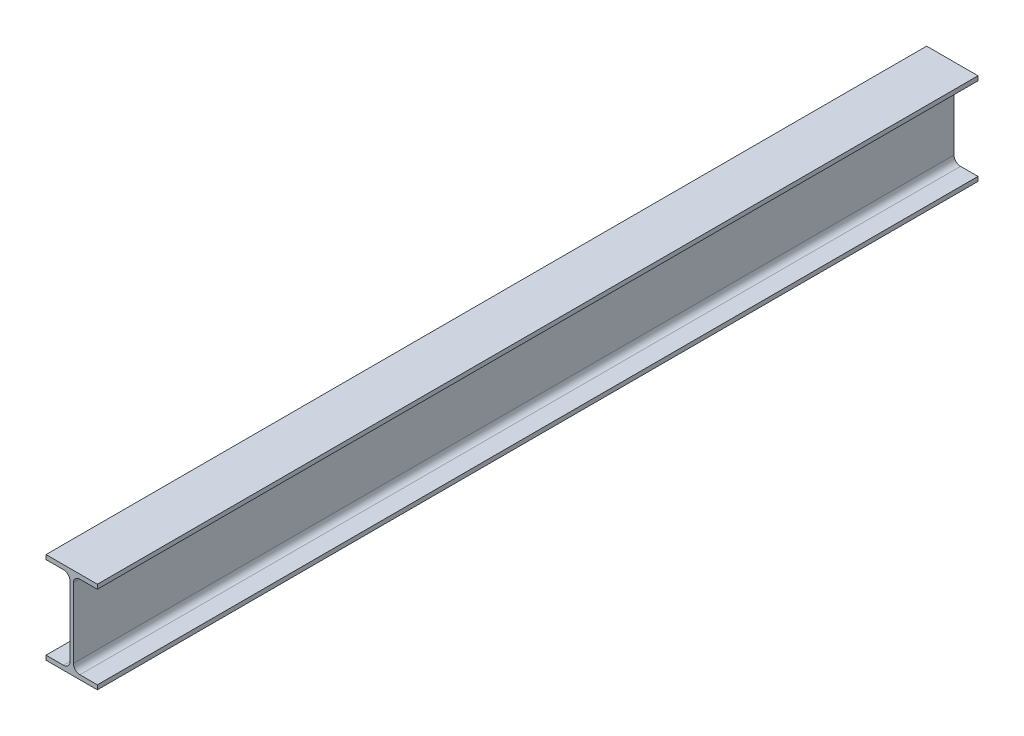
ISO-10303-21;
HEADER;
FILE_DESCRIPTION(('STEP AP214'),'2;1');
FILE_NAME('part.step','',(''),(''),'','','');
FILE_SCHEMA(('AUTOMOTIVE_DESIGN { 1 0 10303 214 1 1 1 1 }'));
ENDSEC;
DATA;
#1=APPLICATION_CONTEXT('core data for automotive mechanical design processes');
#2=APPLICATION_PROTOCOL_DEFINITION('international standard','automotive_design',2000,#1);
#3=PRODUCT_CONTEXT('',#1,'mechanical');
#4=PRODUCT('Part','Part','',(#3));
#5=PRODUCT_RELATED_PRODUCT_CATEGORY('part','',(#4));
#6=PRODUCT_DEFINITION_FORMATION('','',#4);
#7=PRODUCT_DEFINITION_CONTEXT('part definition',#1,'design');
#8=PRODUCT_DEFINITION('design','',#6,#7);
#9=PRODUCT_DEFINITION_SHAPE('','',#8);
#10=(LENGTH_UNIT() NAMED_UNIT(*) SI_UNIT(.MILLI.,.METRE.));
#11=(NAMED_UNIT(*) PLANE_ANGLE_UNIT() SI_UNIT($,.RADIAN.));
#12=(NAMED_UNIT(*) SI_UNIT($,.STERADIAN.) SOLID_ANGLE_UNIT());
#13=UNCERTAINTY_MEASURE_WITH_UNIT(LENGTH_MEASURE(1.E-05),#10,'distance_accuracy_value','');
#14=(GEOMETRIC_REPRESENTATION_CONTEXT(3) GLOBAL_UNCERTAINTY_ASSIGNED_CONTEXT((#13)) GLOBAL_UNIT_ASSIGNED_CONTEXT((#10,
#11,#12)) REPRESENTATION_CONTEXT('',''));
#15=CARTESIAN_POINT('',(0.,0.,0.));
#16=DIRECTION('',(0.,0.,1.));
#17=DIRECTION('',(1.,0.,0.));
#18=AXIS2_PLACEMENT_3D('',#15,#16,#17);
#19=CARTESIAN_POINT('',(-27.5,44.3,943.));
#20=DIRECTION('',(1.,0.,0.));
#21=DIRECTION('',(0.,0.,-1.));
#22=AXIS2_PLACEMENT_3D('',#19,#20,#21);
#23=PLANE('',#22);
#24=DIRECTION('',(0.,-1.,0.));
#25=VECTOR('',#24,1.);
#26=CARTESIAN_POINT('',(-27.5,44.3,0.));
#27=LINE('',#26,#25);
#28=CARTESIAN_POINT('',(-27.5,49.,0.));
#29=VERTEX_POINT('',#28);
#30=CARTESIAN_POINT('',(-27.5,44.3,0.));
#31=VERTEX_POINT('',#30);
#32=EDGE_CURVE('E183',#29,#31,#27,.T.);
#33=ORIENTED_EDGE('',*,*,#32,.T.);
#34=DIRECTION('',(0.,0.,-1.));
#35=VECTOR('',#34,1.);
#36=CARTESIAN_POINT('',(-27.5,44.3,943.));
#37=LINE('',#36,#35);
#38=CARTESIAN_POINT('',(-27.5,44.3,943.));
#39=VERTEX_POINT('',#38);
#40=EDGE_CURVE('E11',#39,#31,#37,.T.);
#41=ORIENTED_EDGE('',*,*,#40,.F.);
#42=DIRECTION('',(0.,-1.,0.));
#43=VECTOR('',#42,1.);
#44=CARTESIAN_POINT('',(-27.5,44.3,943.));
#45=LINE('',#44,#43);
#46=CARTESIAN_POINT('',(-27.5,49.,943.));
#47=VERTEX_POINT('',#46);
#48=EDGE_CURVE('E213',#47,#39,#45,.T.);
#49=ORIENTED_EDGE('',*,*,#48,.F.);
#50=DIRECTION('',(0.,0.,-1.));
#51=VECTOR('',#50,1.);
#52=CARTESIAN_POINT('',(-27.5,49.,943.));
#53=LINE('',#52,#51);
#54=EDGE_CURVE('E179',#47,#29,#53,.T.);
#55=ORIENTED_EDGE('',*,*,#54,.T.);
#56=EDGE_LOOP('',(#33,#41,#49,#55));
#57=FACE_BOUND('',#56,.T.);
#58=ADVANCED_FACE('F39',(#57),#23,.F.);
#59=CARTESIAN_POINT('',(-8.8,44.3,943.));
#60=DIRECTION('',(0.,1.,0.));
#61=DIRECTION('',(0.,0.,1.));
#62=AXIS2_PLACEMENT_3D('',#59,#60,#61);
#63=PLANE('',#62);
#64=DIRECTION('',(1.,0.,0.));
#65=VECTOR('',#64,1.);
#66=CARTESIAN_POINT('',(-8.8,44.3,0.));
#67=LINE('',#66,#65);
#68=CARTESIAN_POINT('',(-8.8,44.3,0.));
#69=VERTEX_POINT('',#68);
#70=EDGE_CURVE('E186',#31,#69,#67,.T.);
#71=ORIENTED_EDGE('',*,*,#70,.T.);
#72=DIRECTION('',(0.,0.,-1.));
#73=VECTOR('',#72,1.);
#74=CARTESIAN_POINT('',(-8.8,44.3,943.));
#75=LINE('',#74,#73);
#76=CARTESIAN_POINT('',(-8.8,44.3,943.));
#77=VERTEX_POINT('',#76);
#78=EDGE_CURVE('E47',#77,#69,#75,.T.);
#79=ORIENTED_EDGE('',*,*,#78,.F.);
#80=DIRECTION('',(1.,0.,0.));
#81=VECTOR('',#80,1.);
#82=CARTESIAN_POINT('',(-8.8,44.3,943.));
#83=LINE('',#82,#81);
#84=EDGE_CURVE('E122',#39,#77,#83,.T.);
#85=ORIENTED_EDGE('',*,*,#84,.F.);
#86=ORIENTED_EDGE('',*,*,#40,.T.);
#87=EDGE_LOOP('',(#71,#79,#85,#86));
#88=FACE_BOUND('',#87,.T.);
#89=ADVANCED_FACE('F311',(#88),#63,.F.);
#90=CARTESIAN_POINT('',(-8.8,37.3,943.));
#91=DIRECTION('',(0.,0.,-1.));
#92=DIRECTION('',(-1.,0.,0.));
#93=AXIS2_PLACEMENT_3D('',#90,#91,#92);
#94=CYLINDRICAL_SURFACE('',#93,7.);
#95=CARTESIAN_POINT('',(-8.8,37.3,0.));
#96=DIRECTION('',(0.,0.,-1.));
#97=DIRECTION('',(-1.,0.,0.));
#98=AXIS2_PLACEMENT_3D('',#95,#96,#97);
#99=CIRCLE('',#98,7.);
#100=CARTESIAN_POINT('',(-1.8,37.3,0.));
#101=VERTEX_POINT('',#100);
#102=EDGE_CURVE('E188',#69,#101,#99,.T.);
#103=ORIENTED_EDGE('',*,*,#102,.T.);
#104=DIRECTION('',(0.,0.,-1.));
#105=VECTOR('',#104,1.);
#106=CARTESIAN_POINT('',(-1.8,37.3,943.));
#107=LINE('',#106,#105);
#108=CARTESIAN_POINT('',(-1.8,37.3,943.));
#109=VERTEX_POINT('',#108);
#110=EDGE_CURVE('E244',#109,#101,#107,.T.);
#111=ORIENTED_EDGE('',*,*,#110,.F.);
#112=CARTESIAN_POINT('',(-8.8,37.3,943.));
#113=DIRECTION('',(0.,0.,-1.));
#114=DIRECTION('',(-1.,0.,0.));
#115=AXIS2_PLACEMENT_3D('',#112,#113,#114);
#116=CIRCLE('',#115,7.);
#117=EDGE_CURVE('E252',#77,#109,#116,.T.);
#118=ORIENTED_EDGE('',*,*,#117,.F.);
#119=ORIENTED_EDGE('',*,*,#78,.T.);
#120=EDGE_LOOP('',(#103,#111,#118,#119));
#121=FACE_BOUND('',#120,.T.);
#122=ADVANCED_FACE('F250',(#121),#94,.F.);
#123=CARTESIAN_POINT('',(-1.8,-37.3,943.));
#124=DIRECTION('',(1.,0.,0.));
#125=DIRECTION('',(0.,1.,0.));
#126=AXIS2_PLACEMENT_3D('',#123,#124,#125);
#127=PLANE('',#126);
#128=DIRECTION('',(0.,-1.,0.));
#129=VECTOR('',#128,1.);
#130=CARTESIAN_POINT('',(-1.8,-37.3,0.));
#131=LINE('',#130,#129);
#132=CARTESIAN_POINT('',(-1.8,-37.3,0.));
#133=VERTEX_POINT('',#132);
#134=EDGE_CURVE('E190',#101,#133,#131,.T.);
#135=ORIENTED_EDGE('',*,*,#134,.T.);
#136=DIRECTION('',(0.,0.,-1.));
#137=VECTOR('',#136,1.);
#138=CARTESIAN_POINT('',(-1.8,-37.3,943.));
#139=LINE('',#138,#137);
#140=CARTESIAN_POINT('',(-1.8,-37.3,943.));
#141=VERTEX_POINT('',#140);
#142=EDGE_CURVE('E241',#141,#133,#139,.T.);
#143=ORIENTED_EDGE('',*,*,#142,.F.);
#144=DIRECTION('',(0.,-1.,0.));
#145=VECTOR('',#144,1.);
#146=CARTESIAN_POINT('',(-1.8,-37.3,943.));
#147=LINE('',#146,#145);
#148=EDGE_CURVE('E270',#109,#141,#147,.T.);
#149=ORIENTED_EDGE('',*,*,#148,.F.);
#150=ORIENTED_EDGE('',*,*,#110,.T.);
#151=EDGE_LOOP('',(#135,#143,#149,#150));
#152=FACE_BOUND('',#151,.T.);
#153=ADVANCED_FACE('F261',(#152),#127,.F.);
#154=CARTESIAN_POINT('',(-8.8,-37.3,943.));
#155=DIRECTION('',(0.,0.,-1.));
#156=DIRECTION('',(-1.,0.,0.));
#157=AXIS2_PLACEMENT_3D('',#154,#155,#156);
#158=CYLINDRICAL_SURFACE('',#157,7.);
#159=CARTESIAN_POINT('',(-8.8,-37.3,0.));
#160=DIRECTION('',(0.,0.,-1.));
#161=DIRECTION('',(-1.,0.,0.));
#162=AXIS2_PLACEMENT_3D('',#159,#160,#161);
#163=CIRCLE('',#162,7.);
#164=CARTESIAN_POINT('',(-8.8,-44.3,0.));
#165=VERTEX_POINT('',#164);
#166=EDGE_CURVE('E192',#133,#165,#163,.T.);
#167=ORIENTED_EDGE('',*,*,#166,.T.);
#168=DIRECTION('',(0.,0.,-1.));
#169=VECTOR('',#168,1.);
#170=CARTESIAN_POINT('',(-8.8,-44.3,943.));
#171=LINE('',#170,#169);
#172=CARTESIAN_POINT('',(-8.8,-44.3,943.));
#173=VERTEX_POINT('',#172);
#174=EDGE_CURVE('E238',#173,#165,#171,.T.);
#175=ORIENTED_EDGE('',*,*,#174,.F.);
#176=CARTESIAN_POINT('',(-8.8,-37.3,943.));
#177=DIRECTION('',(0.,0.,-1.));
#178=DIRECTION('',(-1.,0.,0.));
#179=AXIS2_PLACEMENT_3D('',#176,#177,#178);
#180=CIRCLE('',#179,7.);
#181=EDGE_CURVE('E267',#141,#173,#180,.T.);
#182=ORIENTED_EDGE('',*,*,#181,.F.);
#183=ORIENTED_EDGE('',*,*,#142,.T.);
#184=EDGE_LOOP('',(#167,#175,#182,#183));
#185=FACE_BOUND('',#184,.T.);
#186=ADVANCED_FACE('F265',(#185),#158,.F.);
#187=CARTESIAN_POINT('',(-27.5,-44.3,943.));
#188=DIRECTION('',(0.,-1.,0.));
#189=DIRECTION('',(0.,0.,-1.));
#190=AXIS2_PLACEMENT_3D('',#187,#188,#189);
#191=PLANE('',#190);
#192=DIRECTION('',(-1.,0.,0.));
#193=VECTOR('',#192,1.);
#194=CARTESIAN_POINT('',(-27.5,-44.3,0.));
#195=LINE('',#194,#193);
#196=CARTESIAN_POINT('',(-27.5,-44.3,0.));
#197=VERTEX_POINT('',#196);
#198=EDGE_CURVE('E194',#165,#197,#195,.T.);
#199=ORIENTED_EDGE('',*,*,#198,.T.);
#200=DIRECTION('',(0.,0.,-1.));
#201=VECTOR('',#200,1.);
#202=CARTESIAN_POINT('',(-27.5,-44.3,943.));
#203=LINE('',#202,#201);
#204=CARTESIAN_POINT('',(-27.5,-44.3,943.));
#205=VERTEX_POINT('',#204);
#206=EDGE_CURVE('E235',#205,#197,#203,.T.);
#207=ORIENTED_EDGE('',*,*,#206,.F.);
#208=DIRECTION('',(-1.,0.,0.));
#209=VECTOR('',#208,1.);
#210=CARTESIAN_POINT('',(-27.5,-44.3,943.));
#211=LINE('',#210,#209);
#212=EDGE_CURVE('E269',#173,#205,#211,.T.);
#213=ORIENTED_EDGE('',*,*,#212,.F.);
#214=ORIENTED_EDGE('',*,*,#174,.T.);
#215=EDGE_LOOP('',(#199,#207,#213,#214));
#216=FACE_BOUND('',#215,.T.);
#217=ADVANCED_FACE('F324',(#216),#191,.F.);
#218=CARTESIAN_POINT('',(-27.5,-49.,943.));
#219=DIRECTION('',(1.,0.,0.));
#220=DIRECTION('',(0.,0.,-1.));
#221=AXIS2_PLACEMENT_3D('',#218,#219,#220);
#222=PLANE('',#221);
#223=DIRECTION('',(0.,-1.,0.));
#224=VECTOR('',#223,1.);
#225=CARTESIAN_POINT('',(-27.5,-49.,0.));
#226=LINE('',#225,#224);
#227=CARTESIAN_POINT('',(-27.5,-49.,0.));
#228=VERTEX_POINT('',#227);
#229=EDGE_CURVE('E196',#197,#228,#226,.T.);
#230=ORIENTED_EDGE('',*,*,#229,.T.);
#231=DIRECTION('',(0.,0.,-1.));
#232=VECTOR('',#231,1.);
#233=CARTESIAN_POINT('',(-27.5,-49.,943.));
#234=LINE('',#233,#232);
#235=CARTESIAN_POINT('',(-27.5,-49.,943.));
#236=VERTEX_POINT('',#235);
#237=EDGE_CURVE('E232',#236,#228,#234,.T.);
#238=ORIENTED_EDGE('',*,*,#237,.F.);
#239=DIRECTION('',(0.,-1.,0.));
#240=VECTOR('',#239,1.);
#241=CARTESIAN_POINT('',(-27.5,-49.,943.));
#242=LINE('',#241,#240);
#243=EDGE_CURVE('E272',#205,#236,#242,.T.);
#244=ORIENTED_EDGE('',*,*,#243,.F.);
#245=ORIENTED_EDGE('',*,*,#206,.T.);
#246=EDGE_LOOP('',(#230,#238,#244,#245));
#247=FACE_BOUND('',#246,.T.);
#248=ADVANCED_FACE('F327',(#247),#222,.F.);
#249=CARTESIAN_POINT('',(27.5,-49.,943.));
#250=DIRECTION('',(0.,1.,0.));
#251=DIRECTION('',(-1.,0.,0.));
#252=AXIS2_PLACEMENT_3D('',#249,#250,#251);
#253=PLANE('',#252);
#254=DIRECTION('',(1.,0.,0.));
#255=VECTOR('',#254,1.);
#256=CARTESIAN_POINT('',(27.5,-49.,0.));
#257=LINE('',#256,#255);
#258=CARTESIAN_POINT('',(27.5,-49.,0.));
#259=VERTEX_POINT('',#258);
#260=EDGE_CURVE('E198',#228,#259,#257,.T.);
#261=ORIENTED_EDGE('',*,*,#260,.T.);
#262=DIRECTION('',(0.,0.,-1.));
#263=VECTOR('',#262,1.);
#264=CARTESIAN_POINT('',(27.5,-49.,943.));
#265=LINE('',#264,#263);
#266=CARTESIAN_POINT('',(27.5,-49.,943.));
#267=VERTEX_POINT('',#266);
#268=EDGE_CURVE('E229',#267,#259,#265,.T.);
#269=ORIENTED_EDGE('',*,*,#268,.F.);
#270=DIRECTION('',(1.,0.,0.));
#271=VECTOR('',#270,1.);
#272=CARTESIAN_POINT('',(27.5,-49.,943.));
#273=LINE('',#272,#271);
#274=EDGE_CURVE('E278',#236,#267,#273,.T.);
#275=ORIENTED_EDGE('',*,*,#274,.F.);
#276=ORIENTED_EDGE('',*,*,#237,.T.);
#277=EDGE_LOOP('',(#261,#269,#275,#276));
#278=FACE_BOUND('',#277,.T.);
#279=ADVANCED_FACE('F331',(#278),#253,.F.);
#280=CARTESIAN_POINT('',(27.5,-44.3,943.));
#281=DIRECTION('',(-1.,0.,0.));
#282=DIRECTION('',(0.,0.,1.));
#283=AXIS2_PLACEMENT_3D('',#280,#281,#282);
#284=PLANE('',#283);
#285=DIRECTION('',(0.,1.,0.));
#286=VECTOR('',#285,1.);
#287=CARTESIAN_POINT('',(27.5,-44.3,0.));
#288=LINE('',#287,#286);
#289=CARTESIAN_POINT('',(27.5,-44.3,0.));
#290=VERTEX_POINT('',#289);
#291=EDGE_CURVE('E200',#259,#290,#288,.T.);
#292=ORIENTED_EDGE('',*,*,#291,.T.);
#293=DIRECTION('',(0.,0.,-1.));
#294=VECTOR('',#293,1.);
#295=CARTESIAN_POINT('',(27.5,-44.3,943.));
#296=LINE('',#295,#294);
#297=CARTESIAN_POINT('',(27.5,-44.3,943.));
#298=VERTEX_POINT('',#297);
#299=EDGE_CURVE('E226',#298,#290,#296,.T.);
#300=ORIENTED_EDGE('',*,*,#299,.F.);
#301=DIRECTION('',(0.,1.,0.));
#302=VECTOR('',#301,1.);
#303=CARTESIAN_POINT('',(27.5,-44.3,943.));
#304=LINE('',#303,#302);
#305=EDGE_CURVE('E280',#267,#298,#304,.T.);
#306=ORIENTED_EDGE('',*,*,#305,.F.);
#307=ORIENTED_EDGE('',*,*,#268,.T.);
#308=EDGE_LOOP('',(#292,#300,#306,#307));
#309=FACE_BOUND('',#308,.T.);
#310=ADVANCED_FACE('F335',(#309),#284,.F.);
#311=CARTESIAN_POINT('',(8.80000000000001,-44.3,943.));
#312=DIRECTION('',(0.,-1.,0.));
#313=DIRECTION('',(1.,0.,0.));
#314=AXIS2_PLACEMENT_3D('',#311,#312,#313);
#315=PLANE('',#314);
#316=DIRECTION('',(-1.,0.,0.));
#317=VECTOR('',#316,1.);
#318=CARTESIAN_POINT('',(8.80000000000001,-44.3,0.));
#319=LINE('',#318,#317);
#320=CARTESIAN_POINT('',(8.80000000000001,-44.3,0.));
#321=VERTEX_POINT('',#320);
#322=EDGE_CURVE('E202',#290,#321,#319,.T.);
#323=ORIENTED_EDGE('',*,*,#322,.T.);
#324=DIRECTION('',(0.,0.,-1.));
#325=VECTOR('',#324,1.);
#326=CARTESIAN_POINT('',(8.80000000000001,-44.3,943.));
#327=LINE('',#326,#325);
#328=CARTESIAN_POINT('',(8.80000000000001,-44.3,943.));
#329=VERTEX_POINT('',#328);
#330=EDGE_CURVE('E223',#329,#321,#327,.T.);
#331=ORIENTED_EDGE('',*,*,#330,.F.);
#332=DIRECTION('',(-1.,0.,0.));
#333=VECTOR('',#332,1.);
#334=CARTESIAN_POINT('',(8.80000000000001,-44.3,943.));
#335=LINE('',#334,#333);
#336=EDGE_CURVE('E282',#298,#329,#335,.T.);
#337=ORIENTED_EDGE('',*,*,#336,.F.);
#338=ORIENTED_EDGE('',*,*,#299,.T.);
#339=EDGE_LOOP('',(#323,#331,#337,#338));
#340=FACE_BOUND('',#339,.T.);
#341=ADVANCED_FACE('F339',(#340),#315,.F.);
#342=CARTESIAN_POINT('',(8.80000000000001,-37.3,943.));
#343=DIRECTION('',(0.,0.,-1.));
#344=DIRECTION('',(-1.,0.,0.));
#345=AXIS2_PLACEMENT_3D('',#342,#343,#344);
#346=CYLINDRICAL_SURFACE('',#345,7.);
#347=CARTESIAN_POINT('',(8.80000000000001,-37.3,0.));
#348=DIRECTION('',(0.,0.,-1.));
#349=DIRECTION('',(-1.,0.,0.));
#350=AXIS2_PLACEMENT_3D('',#347,#348,#349);
#351=CIRCLE('',#350,7.);
#352=CARTESIAN_POINT('',(1.80000000000001,-37.3,0.));
#353=VERTEX_POINT('',#352);
#354=EDGE_CURVE('E204',#321,#353,#351,.T.);
#355=ORIENTED_EDGE('',*,*,#354,.T.);
#356=DIRECTION('',(0.,0.,-1.));
#357=VECTOR('',#356,1.);
#358=CARTESIAN_POINT('',(1.80000000000001,-37.3,943.));
#359=LINE('',#358,#357);
#360=CARTESIAN_POINT('',(1.80000000000001,-37.3,943.));
#361=VERTEX_POINT('',#360);
#362=EDGE_CURVE('E220',#361,#353,#359,.T.);
#363=ORIENTED_EDGE('',*,*,#362,.F.);
#364=CARTESIAN_POINT('',(8.80000000000001,-37.3,943.));
#365=DIRECTION('',(0.,0.,-1.));
#366=DIRECTION('',(-1.,0.,0.));
#367=AXIS2_PLACEMENT_3D('',#364,#365,#366);
#368=CIRCLE('',#367,7.);
#369=EDGE_CURVE('E284',#329,#361,#368,.T.);
#370=ORIENTED_EDGE('',*,*,#369,.F.);
#371=ORIENTED_EDGE('',*,*,#330,.T.);
#372=EDGE_LOOP('',(#355,#363,#370,#371));
#373=FACE_BOUND('',#372,.T.);
#374=ADVANCED_FACE('F343',(#373),#346,.F.);
#375=CARTESIAN_POINT('',(1.8,37.3,943.));
#376=DIRECTION('',(-1.,0.,0.));
#377=DIRECTION('',(0.,-1.,0.));
#378=AXIS2_PLACEMENT_3D('',#375,#376,#377);
#379=PLANE('',#378);
#380=DIRECTION('',(0.,1.,0.));
#381=VECTOR('',#380,1.);
#382=CARTESIAN_POINT('',(1.8,37.3,0.));
#383=LINE('',#382,#381);
#384=CARTESIAN_POINT('',(1.8,37.3,0.));
#385=VERTEX_POINT('',#384);
#386=EDGE_CURVE('E206',#353,#385,#383,.T.);
#387=ORIENTED_EDGE('',*,*,#386,.T.);
#388=DIRECTION('',(0.,0.,-1.));
#389=VECTOR('',#388,1.);
#390=CARTESIAN_POINT('',(1.8,37.3,943.));
#391=LINE('',#390,#389);
#392=CARTESIAN_POINT('',(1.8,37.3,943.));
#393=VERTEX_POINT('',#392);
#394=EDGE_CURVE('E217',#393,#385,#391,.T.);
#395=ORIENTED_EDGE('',*,*,#394,.F.);
#396=DIRECTION('',(0.,1.,0.));
#397=VECTOR('',#396,1.);
#398=CARTESIAN_POINT('',(1.8,37.3,943.));
#399=LINE('',#398,#397);
#400=EDGE_CURVE('E286',#361,#393,#399,.T.);
#401=ORIENTED_EDGE('',*,*,#400,.F.);
#402=ORIENTED_EDGE('',*,*,#362,.T.);
#403=EDGE_LOOP('',(#387,#395,#401,#402));
#404=FACE_BOUND('',#403,.T.);
#405=ADVANCED_FACE('F292',(#404),#379,.F.);
#406=CARTESIAN_POINT('',(8.8,37.3,943.));
#407=DIRECTION('',(0.,0.,-1.));
#408=DIRECTION('',(-1.,0.,0.));
#409=AXIS2_PLACEMENT_3D('',#406,#407,#408);
#410=CYLINDRICAL_SURFACE('',#409,7.);
#411=CARTESIAN_POINT('',(8.8,37.3,0.));
#412=DIRECTION('',(0.,0.,-1.));
#413=DIRECTION('',(-1.,0.,0.));
#414=AXIS2_PLACEMENT_3D('',#411,#412,#413);
#415=CIRCLE('',#414,7.);
#416=CARTESIAN_POINT('',(8.8,44.3,0.));
#417=VERTEX_POINT('',#416);
#418=EDGE_CURVE('E208',#385,#417,#415,.T.);
#419=ORIENTED_EDGE('',*,*,#418,.T.);
#420=DIRECTION('',(0.,0.,-1.));
#421=VECTOR('',#420,1.);
#422=CARTESIAN_POINT('',(8.8,44.3,943.));
#423=LINE('',#422,#421);
#424=CARTESIAN_POINT('',(8.8,44.3,943.));
#425=VERTEX_POINT('',#424);
#426=EDGE_CURVE('E174',#425,#417,#423,.T.);
#427=ORIENTED_EDGE('',*,*,#426,.F.);
#428=CARTESIAN_POINT('',(8.8,37.3,943.));
#429=DIRECTION('',(0.,0.,-1.));
#430=DIRECTION('',(-1.,0.,0.));
#431=AXIS2_PLACEMENT_3D('',#428,#429,#430);
#432=CIRCLE('',#431,7.);
#433=EDGE_CURVE('E165',#393,#425,#432,.T.);
#434=ORIENTED_EDGE('',*,*,#433,.F.);
#435=ORIENTED_EDGE('',*,*,#394,.T.);
#436=EDGE_LOOP('',(#419,#427,#434,#435));
#437=FACE_BOUND('',#436,.T.);
#438=ADVANCED_FACE('F296',(#437),#410,.F.);
#439=CARTESIAN_POINT('',(27.5,44.3,943.));
#440=DIRECTION('',(0.,1.,0.));
#441=DIRECTION('',(0.,0.,1.));
#442=AXIS2_PLACEMENT_3D('',#439,#440,#441);
#443=PLANE('',#442);
#444=DIRECTION('',(1.,0.,0.));
#445=VECTOR('',#444,1.);
#446=CARTESIAN_POINT('',(27.5,44.3,0.));
#447=LINE('',#446,#445);
#448=CARTESIAN_POINT('',(27.5,44.3,0.));
#449=VERTEX_POINT('',#448);
#450=EDGE_CURVE('E173',#417,#449,#447,.T.);
#451=ORIENTED_EDGE('',*,*,#450,.T.);
#452=DIRECTION('',(0.,0.,-1.));
#453=VECTOR('',#452,1.);
#454=CARTESIAN_POINT('',(27.5,44.3,943.));
#455=LINE('',#454,#453);
#456=CARTESIAN_POINT('',(27.5,44.3,943.));
#457=VERTEX_POINT('',#456);
#458=EDGE_CURVE('E170',#457,#449,#455,.T.);
#459=ORIENTED_EDGE('',*,*,#458,.F.);
#460=DIRECTION('',(1.,0.,0.));
#461=VECTOR('',#460,1.);
#462=CARTESIAN_POINT('',(27.5,44.3,943.));
#463=LINE('',#462,#461);
#464=EDGE_CURVE('E159',#425,#457,#463,.T.);
#465=ORIENTED_EDGE('',*,*,#464,.F.);
#466=ORIENTED_EDGE('',*,*,#426,.T.);
#467=EDGE_LOOP('',(#451,#459,#465,#466));
#468=FACE_BOUND('',#467,.T.);
#469=ADVANCED_FACE('F171',(#468),#443,.F.);
#470=CARTESIAN_POINT('',(27.5,49.,943.));
#471=DIRECTION('',(-1.,0.,0.));
#472=DIRECTION('',(0.,-1.,0.));
#473=AXIS2_PLACEMENT_3D('',#470,#471,#472);
#474=PLANE('',#473);
#475=DIRECTION('',(0.,1.,0.));
#476=VECTOR('',#475,1.);
#477=CARTESIAN_POINT('',(27.5,49.,0.));
#478=LINE('',#477,#476);
#479=CARTESIAN_POINT('',(27.5,49.,0.));
#480=VERTEX_POINT('',#479);
#481=EDGE_CURVE('E108',#449,#480,#478,.T.);
#482=ORIENTED_EDGE('',*,*,#481,.T.);
#483=DIRECTION('',(0.,0.,-1.));
#484=VECTOR('',#483,1.);
#485=CARTESIAN_POINT('',(27.5,49.,943.));
#486=LINE('',#485,#484);
#487=CARTESIAN_POINT('',(27.5,49.,943.));
#488=VERTEX_POINT('',#487);
#489=EDGE_CURVE('E175',#488,#480,#486,.T.);
#490=ORIENTED_EDGE('',*,*,#489,.F.);
#491=DIRECTION('',(0.,1.,0.));
#492=VECTOR('',#491,1.);
#493=CARTESIAN_POINT('',(27.5,49.,943.));
#494=LINE('',#493,#492);
#495=EDGE_CURVE('E163',#457,#488,#494,.T.);
#496=ORIENTED_EDGE('',*,*,#495,.F.);
#497=ORIENTED_EDGE('',*,*,#458,.T.);
#498=EDGE_LOOP('',(#482,#490,#496,#497));
#499=FACE_BOUND('',#498,.T.);
#500=ADVANCED_FACE('F177',(#499),#474,.F.);
#501=CARTESIAN_POINT('',(-27.5,49.,943.));
#502=DIRECTION('',(0.,-1.,0.));
#503=DIRECTION('',(0.,0.,-1.));
#504=AXIS2_PLACEMENT_3D('',#501,#502,#503);
#505=PLANE('',#504);
#506=DIRECTION('',(-1.,0.,0.));
#507=VECTOR('',#506,1.);
#508=CARTESIAN_POINT('',(-27.5,49.,0.));
#509=LINE('',#508,#507);
#510=EDGE_CURVE('E114',#480,#29,#509,.T.);
#511=ORIENTED_EDGE('',*,*,#510,.T.);
#512=ORIENTED_EDGE('',*,*,#54,.F.);
#513=DIRECTION('',(-1.,0.,0.));
#514=VECTOR('',#513,1.);
#515=CARTESIAN_POINT('',(-27.5,49.,943.));
#516=LINE('',#515,#514);
#517=EDGE_CURVE('E55',#488,#47,#516,.T.);
#518=ORIENTED_EDGE('',*,*,#517,.F.);
#519=ORIENTED_EDGE('',*,*,#489,.T.);
#520=EDGE_LOOP('',(#511,#512,#518,#519));
#521=FACE_BOUND('',#520,.T.);
#522=ADVANCED_FACE('F300',(#521),#505,.F.);
#523=CARTESIAN_POINT('',(8.8,37.3,943.));
#524=DIRECTION('',(0.,0.,-1.));
#525=DIRECTION('',(-1.,0.,0.));
#526=AXIS2_PLACEMENT_3D('',#523,#524,#525);
#527=PLANE('',#526);
#528=ORIENTED_EDGE('',*,*,#48,.T.);
#529=ORIENTED_EDGE('',*,*,#84,.T.);
#530=ORIENTED_EDGE('',*,*,#117,.T.);
#531=ORIENTED_EDGE('',*,*,#148,.T.);
#532=ORIENTED_EDGE('',*,*,#181,.T.);
#533=ORIENTED_EDGE('',*,*,#212,.T.);
#534=ORIENTED_EDGE('',*,*,#243,.T.);
#535=ORIENTED_EDGE('',*,*,#274,.T.);
#536=ORIENTED_EDGE('',*,*,#305,.T.);
#537=ORIENTED_EDGE('',*,*,#336,.T.);
#538=ORIENTED_EDGE('',*,*,#369,.T.);
#539=ORIENTED_EDGE('',*,*,#400,.T.);
#540=ORIENTED_EDGE('',*,*,#433,.T.);
#541=ORIENTED_EDGE('',*,*,#464,.T.);
#542=ORIENTED_EDGE('',*,*,#495,.T.);
#543=ORIENTED_EDGE('',*,*,#517,.T.);
#544=EDGE_LOOP('',(#528,#529,#530,#531,#532,#533,#534,#535,#536,#537,#538,#539,#540,#541,#542,#543));
#545=FACE_BOUND('',#544,.T.);
#546=ADVANCED_FACE('F161',(#545),#527,.F.);
#547=CARTESIAN_POINT('',(8.8,37.3,0.));
#548=DIRECTION('',(0.,0.,-1.));
#549=DIRECTION('',(-1.,0.,0.));
#550=AXIS2_PLACEMENT_3D('',#547,#548,#549);
#551=PLANE('',#550);
#552=ORIENTED_EDGE('',*,*,#32,.F.);
#553=ORIENTED_EDGE('',*,*,#510,.F.);
#554=ORIENTED_EDGE('',*,*,#481,.F.);
#555=ORIENTED_EDGE('',*,*,#450,.F.);
#556=ORIENTED_EDGE('',*,*,#418,.F.);
#557=ORIENTED_EDGE('',*,*,#386,.F.);
#558=ORIENTED_EDGE('',*,*,#354,.F.);
#559=ORIENTED_EDGE('',*,*,#322,.F.);
#560=ORIENTED_EDGE('',*,*,#291,.F.);
#561=ORIENTED_EDGE('',*,*,#260,.F.);
#562=ORIENTED_EDGE('',*,*,#229,.F.);
#563=ORIENTED_EDGE('',*,*,#198,.F.);
#564=ORIENTED_EDGE('',*,*,#166,.F.);
#565=ORIENTED_EDGE('',*,*,#134,.F.);
#566=ORIENTED_EDGE('',*,*,#102,.F.);
#567=ORIENTED_EDGE('',*,*,#70,.F.);
#568=EDGE_LOOP('',(#552,#553,#554,#555,#556,#557,#558,#559,#560,#561,#562,#563,#564,#565,#566,#567));
#569=FACE_BOUND('',#568,.T.);
#570=ADVANCED_FACE('F256',(#569),#551,.T.);
#571=CLOSED_SHELL('',(#58,#89,#122,#153,#186,#217,#248,#279,#310,#341,#374,#405,#438,#469,#500,
#522,#546,#570));
#572=MANIFOLD_SOLID_BREP('B2',#571);
#573=ADVANCED_BREP_SHAPE_REPRESENTATION('',(#18,#572),#14);
#574=SHAPE_DEFINITION_REPRESENTATION(#9,#573);
ENDSEC;
END-ISO-10303-21;
